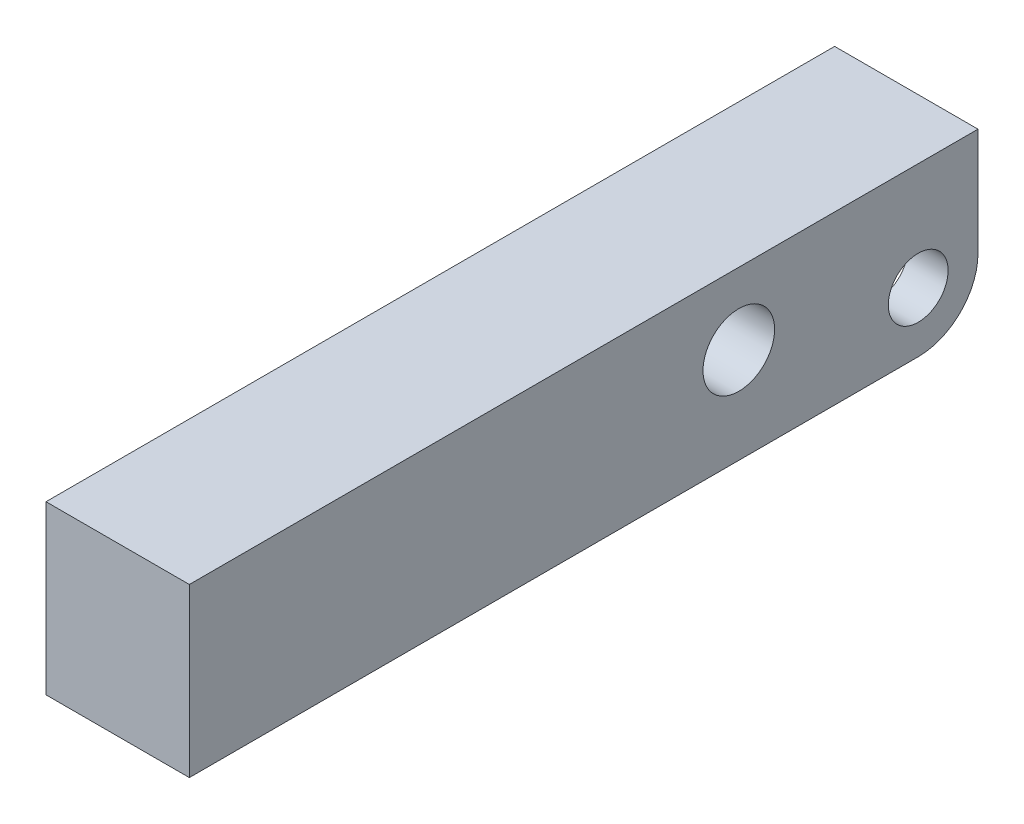
ISO-10303-21;
HEADER;
FILE_DESCRIPTION(('STEP AP214'),'2;1');
FILE_NAME('part.step','',(''),(''),'','','');
FILE_SCHEMA(('AUTOMOTIVE_DESIGN { 1 0 10303 214 1 1 1 1 }'));
ENDSEC;
DATA;
#1=APPLICATION_CONTEXT('core data for automotive mechanical design processes');
#2=APPLICATION_PROTOCOL_DEFINITION('international standard','automotive_design',2000,#1);
#3=PRODUCT_CONTEXT('',#1,'mechanical');
#4=PRODUCT('Part','Part','',(#3));
#5=PRODUCT_RELATED_PRODUCT_CATEGORY('part','',(#4));
#6=PRODUCT_DEFINITION_FORMATION('','',#4);
#7=PRODUCT_DEFINITION_CONTEXT('part definition',#1,'design');
#8=PRODUCT_DEFINITION('design','',#6,#7);
#9=PRODUCT_DEFINITION_SHAPE('','',#8);
#10=(LENGTH_UNIT() NAMED_UNIT(*) SI_UNIT(.MILLI.,.METRE.));
#11=(NAMED_UNIT(*) PLANE_ANGLE_UNIT() SI_UNIT($,.RADIAN.));
#12=(NAMED_UNIT(*) SI_UNIT($,.STERADIAN.) SOLID_ANGLE_UNIT());
#13=UNCERTAINTY_MEASURE_WITH_UNIT(LENGTH_MEASURE(1.E-05),#10,'distance_accuracy_value','');
#14=(GEOMETRIC_REPRESENTATION_CONTEXT(3) GLOBAL_UNCERTAINTY_ASSIGNED_CONTEXT((#13)) GLOBAL_UNIT_ASSIGNED_CONTEXT((#10,
#11,#12)) REPRESENTATION_CONTEXT('',''));
#15=CARTESIAN_POINT('',(0.,0.,0.));
#16=DIRECTION('',(0.,0.,1.));
#17=DIRECTION('',(1.,0.,0.));
#18=AXIS2_PLACEMENT_3D('',#15,#16,#17);
#19=CARTESIAN_POINT('',(-49.9999,5.00379999999999,5.0038));
#20=DIRECTION('',(1.,0.,0.));
#21=DIRECTION('',(0.,0.,-1.));
#22=AXIS2_PLACEMENT_3D('',#19,#20,#21);
#23=CYLINDRICAL_SURFACE('',#22,2.5019);
#24=CARTESIAN_POINT('',(-2.6543,5.00379999999999,5.0038));
#25=DIRECTION('',(-1.,0.,0.));
#26=DIRECTION('',(0.,0.,1.));
#27=AXIS2_PLACEMENT_3D('',#24,#25,#26);
#28=CIRCLE('',#27,2.5019);
#29=CARTESIAN_POINT('',(-2.65430000000001,5.00379999999999,2.5019));
#30=VERTEX_POINT('',#29);
#31=EDGE_CURVE('E198',#30,#30,#28,.F.);
#32=CARTESIAN_POINT('',(-6.,5.00379999999999,5.0038));
#33=DIRECTION('',(-1.,0.,0.));
#34=DIRECTION('',(0.,0.,1.));
#35=AXIS2_PLACEMENT_3D('',#32,#33,#34);
#36=CIRCLE('',#35,2.5019);
#37=CARTESIAN_POINT('',(-6.,5.00379999999999,2.5019));
#38=VERTEX_POINT('',#37);
#39=EDGE_CURVE('E161',#38,#38,#36,.T.);
#40=CARTESIAN_POINT('',(-2.65430000000001,5.00379999999999,2.5019));
#41=CARTESIAN_POINT('',(-2.68915104166667,5.00379999999999,2.5019));
#42=CARTESIAN_POINT('',(-2.72400208333334,5.00379999999999,2.5019));
#43=CARTESIAN_POINT('',(-2.79370416666667,5.00379999999999,2.5019));
#44=CARTESIAN_POINT('',(-2.82855520833334,5.00379999999999,2.5019));
#45=CARTESIAN_POINT('',(-2.89825729166667,5.00379999999999,2.5019));
#46=CARTESIAN_POINT('',(-2.93310833333334,5.00379999999999,2.5019));
#47=CARTESIAN_POINT('',(-3.00281041666667,5.00379999999999,2.5019));
#48=CARTESIAN_POINT('',(-3.03766145833334,5.00379999999999,2.5019));
#49=CARTESIAN_POINT('',(-3.10736354166667,5.00379999999999,2.5019));
#50=CARTESIAN_POINT('',(-3.14221458333334,5.00379999999999,2.5019));
#51=CARTESIAN_POINT('',(-3.21191666666667,5.00379999999999,2.5019));
#52=CARTESIAN_POINT('',(-3.24676770833334,5.00379999999999,2.5019));
#53=CARTESIAN_POINT('',(-3.31646979166667,5.00379999999999,2.5019));
#54=CARTESIAN_POINT('',(-3.35132083333334,5.00379999999999,2.5019));
#55=CARTESIAN_POINT('',(-3.42102291666667,5.00379999999999,2.5019));
#56=CARTESIAN_POINT('',(-3.45587395833334,5.00379999999999,2.5019));
#57=CARTESIAN_POINT('',(-3.52557604166667,5.00379999999999,2.5019));
#58=CARTESIAN_POINT('',(-3.56042708333334,5.00379999999999,2.5019));
#59=CARTESIAN_POINT('',(-3.63012916666667,5.00379999999999,2.5019));
#60=CARTESIAN_POINT('',(-3.66498020833333,5.00379999999999,2.5019));
#61=CARTESIAN_POINT('',(-3.73468229166667,5.00379999999999,2.5019));
#62=CARTESIAN_POINT('',(-3.76953333333334,5.00379999999999,2.5019));
#63=CARTESIAN_POINT('',(-3.83923541666667,5.00379999999999,2.5019));
#64=CARTESIAN_POINT('',(-3.87408645833334,5.00379999999999,2.5019));
#65=CARTESIAN_POINT('',(-3.94378854166667,5.00379999999999,2.5019));
#66=CARTESIAN_POINT('',(-3.97863958333334,5.00379999999999,2.5019));
#67=CARTESIAN_POINT('',(-4.04834166666667,5.00379999999999,2.5019));
#68=CARTESIAN_POINT('',(-4.08319270833334,5.00379999999999,2.5019));
#69=CARTESIAN_POINT('',(-4.15289479166667,5.00379999999999,2.5019));
#70=CARTESIAN_POINT('',(-4.18774583333334,5.00379999999999,2.5019));
#71=CARTESIAN_POINT('',(-4.25744791666667,5.00379999999999,2.5019));
#72=CARTESIAN_POINT('',(-4.29229895833334,5.00379999999999,2.5019));
#73=CARTESIAN_POINT('',(-4.36200104166667,5.00379999999999,2.5019));
#74=CARTESIAN_POINT('',(-4.39685208333333,5.00379999999999,2.5019));
#75=CARTESIAN_POINT('',(-4.46655416666667,5.00379999999999,2.5019));
#76=CARTESIAN_POINT('',(-4.50140520833333,5.00379999999999,2.5019));
#77=CARTESIAN_POINT('',(-4.57110729166667,5.00379999999999,2.5019));
#78=CARTESIAN_POINT('',(-4.60595833333333,5.00379999999999,2.5019));
#79=CARTESIAN_POINT('',(-4.67566041666667,5.00379999999999,2.5019));
#80=CARTESIAN_POINT('',(-4.71051145833333,5.00379999999999,2.5019));
#81=CARTESIAN_POINT('',(-4.78021354166667,5.00379999999999,2.5019));
#82=CARTESIAN_POINT('',(-4.81506458333333,5.00379999999999,2.5019));
#83=CARTESIAN_POINT('',(-4.88476666666667,5.00379999999999,2.5019));
#84=CARTESIAN_POINT('',(-4.91961770833333,5.00379999999999,2.5019));
#85=CARTESIAN_POINT('',(-4.98931979166667,5.00379999999999,2.5019));
#86=CARTESIAN_POINT('',(-5.02417083333333,5.00379999999999,2.5019));
#87=CARTESIAN_POINT('',(-5.09387291666667,5.00379999999999,2.5019));
#88=CARTESIAN_POINT('',(-5.12872395833333,5.00379999999999,2.5019));
#89=CARTESIAN_POINT('',(-5.19842604166667,5.00379999999999,2.5019));
#90=CARTESIAN_POINT('',(-5.23327708333333,5.00379999999999,2.5019));
#91=CARTESIAN_POINT('',(-5.30297916666667,5.00379999999999,2.5019));
#92=CARTESIAN_POINT('',(-5.33783020833333,5.00379999999999,2.5019));
#93=CARTESIAN_POINT('',(-5.40753229166666,5.00379999999999,2.5019));
#94=CARTESIAN_POINT('',(-5.44238333333333,5.00379999999999,2.5019));
#95=CARTESIAN_POINT('',(-5.51208541666667,5.00379999999999,2.5019));
#96=CARTESIAN_POINT('',(-5.54693645833333,5.00379999999999,2.5019));
#97=CARTESIAN_POINT('',(-5.61663854166667,5.00379999999999,2.5019));
#98=CARTESIAN_POINT('',(-5.65148958333333,5.00379999999999,2.5019));
#99=CARTESIAN_POINT('',(-5.72119166666667,5.00379999999999,2.5019));
#100=CARTESIAN_POINT('',(-5.75604270833333,5.00379999999999,2.5019));
#101=CARTESIAN_POINT('',(-5.82574479166667,5.00379999999999,2.5019));
#102=CARTESIAN_POINT('',(-5.86059583333333,5.00379999999999,2.5019));
#103=CARTESIAN_POINT('',(-5.93029791666667,5.00379999999999,2.5019));
#104=CARTESIAN_POINT('',(-5.96514895833333,5.00379999999999,2.5019));
#105=CARTESIAN_POINT('',(-6.,5.00379999999999,2.5019));
#106=B_SPLINE_CURVE_WITH_KNOTS('',3,(#40,#41,#42,#43,#44,#45,#46,#47,#48,#49,#50,#51,#52,#53,
#54,#55,#56,#57,#58,#59,#60,#61,#62,#63,#64,#65,#66,#67,#68,#69,#70,#71,#72,#73,#74,#75,#76,#77,
#78,#79,#80,#81,#82,#83,#84,#85,#86,#87,#88,#89,#90,#91,#92,#93,#94,#95,#96,#97,#98,#99,#100,
#101,#102,#103,#104,#105),.UNSPECIFIED.,.F.,.F.,(4,2,2,2,2,2,2,2,2,2,2,2,2,2,2,2,2,2,2,2,2,2,2,
2,2,2,2,2,2,2,2,2,4),(0.,0.104553124999997,0.20910625,0.313659374999997,0.418212500000001,
0.522765624999998,0.627318750000001,0.731871874999998,0.836425000000002,0.940978124999998,
1.04553125,1.150084375,1.2546375,1.359190625,1.46374375,1.568296875,1.67285,1.77740312499999,
1.88195625,1.98650937499999,2.0910625,2.19561562499999,2.30016875,2.40472187499999,
2.50927499999999,2.613828125,2.71838124999999,2.822934375,2.92748749999999,3.032040625,
3.13659374999999,3.241146875,3.34569999999999),.UNSPECIFIED.);
#107=EDGE_CURVE('BSEAM32',#30,#38,#106,.T.);
#108=ORIENTED_EDGE('',*,*,#31,.T.);
#109=ORIENTED_EDGE('',*,*,#39,.T.);
#110=ORIENTED_EDGE('',*,*,#107,.T.);
#111=ORIENTED_EDGE('',*,*,#107,.F.);
#112=EDGE_LOOP('',(#108,#110,#109,#111));
#113=FACE_BOUND('',#112,.T.);
#114=ADVANCED_FACE('F32',(#113),#23,.F.);
#115=CARTESIAN_POINT('',(-6.,13.9954,0.));
#116=DIRECTION('',(0.,0.,-1.));
#117=DIRECTION('',(0.,1.,0.));
#118=AXIS2_PLACEMENT_3D('',#115,#116,#117);
#119=PLANE('',#118);
#120=DIRECTION('',(0.,1.,0.));
#121=VECTOR('',#120,1.);
#122=CARTESIAN_POINT('',(5.9944,13.9954,0.));
#123=LINE('',#122,#121);
#124=CARTESIAN_POINT('',(5.9944,5.0038,0.));
#125=VERTEX_POINT('',#124);
#126=CARTESIAN_POINT('',(5.9944,13.9954,0.));
#127=VERTEX_POINT('',#126);
#128=EDGE_CURVE('E164',#125,#127,#123,.T.);
#129=ORIENTED_EDGE('',*,*,#128,.F.);
#130=DIRECTION('',(1.,0.,0.));
#131=VECTOR('',#130,1.);
#132=CARTESIAN_POINT('',(-6.,5.0038,0.));
#133=LINE('',#132,#131);
#134=CARTESIAN_POINT('',(2.6543,5.0038,0.));
#135=VERTEX_POINT('',#134);
#136=EDGE_CURVE('E211',#125,#135,#133,.F.);
#137=ORIENTED_EDGE('',*,*,#136,.T.);
#138=DIRECTION('',(0.,-1.,0.));
#139=VECTOR('',#138,1.);
#140=CARTESIAN_POINT('',(2.6543,10.9982,0.));
#141=LINE('',#140,#139);
#142=CARTESIAN_POINT('',(2.6543,10.9982,0.));
#143=VERTEX_POINT('',#142);
#144=EDGE_CURVE('E131',#143,#135,#141,.T.);
#145=ORIENTED_EDGE('',*,*,#144,.F.);
#146=DIRECTION('',(1.,0.,0.));
#147=VECTOR('',#146,1.);
#148=CARTESIAN_POINT('',(-2.6543,10.9982,0.));
#149=LINE('',#148,#147);
#150=CARTESIAN_POINT('',(-2.6543,10.9982,0.));
#151=VERTEX_POINT('',#150);
#152=EDGE_CURVE('E138',#151,#143,#149,.T.);
#153=ORIENTED_EDGE('',*,*,#152,.F.);
#154=DIRECTION('',(0.,-1.,0.));
#155=VECTOR('',#154,1.);
#156=CARTESIAN_POINT('',(-2.6543,10.9982,0.));
#157=LINE('',#156,#155);
#158=CARTESIAN_POINT('',(-2.6543,5.0038,0.));
#159=VERTEX_POINT('',#158);
#160=EDGE_CURVE('E121',#151,#159,#157,.T.);
#161=ORIENTED_EDGE('',*,*,#160,.T.);
#162=DIRECTION('',(1.,0.,0.));
#163=VECTOR('',#162,1.);
#164=CARTESIAN_POINT('',(-6.,5.0038,0.));
#165=LINE('',#164,#163);
#166=CARTESIAN_POINT('',(-6.,5.0038,0.));
#167=VERTEX_POINT('',#166);
#168=EDGE_CURVE('E209',#159,#167,#165,.F.);
#169=ORIENTED_EDGE('',*,*,#168,.T.);
#170=DIRECTION('',(0.,1.,0.));
#171=VECTOR('',#170,1.);
#172=CARTESIAN_POINT('',(-6.,13.9954,0.));
#173=LINE('',#172,#171);
#174=CARTESIAN_POINT('',(-6.,13.9954,0.));
#175=VERTEX_POINT('',#174);
#176=EDGE_CURVE('E175',#167,#175,#173,.T.);
#177=ORIENTED_EDGE('',*,*,#176,.T.);
#178=DIRECTION('',(1.,0.,0.));
#179=VECTOR('',#178,1.);
#180=CARTESIAN_POINT('',(-6.,13.9954,0.));
#181=LINE('',#180,#179);
#182=EDGE_CURVE('E186',#175,#127,#181,.T.);
#183=ORIENTED_EDGE('',*,*,#182,.T.);
#184=EDGE_LOOP('',(#129,#137,#145,#153,#161,#169,#177,#183));
#185=FACE_BOUND('',#184,.T.);
#186=ADVANCED_FACE('F143',(#185),#119,.T.);
#187=CARTESIAN_POINT('',(-6.,0.,0.));
#188=DIRECTION('',(0.,-1.,0.));
#189=DIRECTION('',(0.,0.,-1.));
#190=AXIS2_PLACEMENT_3D('',#187,#188,#189);
#191=PLANE('',#190);
#192=CARTESIAN_POINT('',(0.,0.,10.9855));
#193=DIRECTION('',(0.,-1.,0.));
#194=DIRECTION('',(0.,0.,-1.));
#195=AXIS2_PLACEMENT_3D('',#192,#193,#194);
#196=CIRCLE('',#195,3.4163);
#197=CARTESIAN_POINT('',(-3.4163,0.,10.9855));
#198=VERTEX_POINT('',#197);
#199=CARTESIAN_POINT('',(3.4163,0.,10.9855));
#200=VERTEX_POINT('',#199);
#201=EDGE_CURVE('E224',#198,#200,#196,.F.);
#202=ORIENTED_EDGE('',*,*,#201,.T.);
#203=DIRECTION('',(0.,0.,-1.));
#204=VECTOR('',#203,1.);
#205=CARTESIAN_POINT('',(3.4163,0.,5.0038));
#206=LINE('',#205,#204);
#207=CARTESIAN_POINT('',(3.4163,0.,5.0038));
#208=VERTEX_POINT('',#207);
#209=EDGE_CURVE('E226',#200,#208,#206,.T.);
#210=ORIENTED_EDGE('',*,*,#209,.T.);
#211=DIRECTION('',(1.,0.,0.));
#212=VECTOR('',#211,1.);
#213=CARTESIAN_POINT('',(-6.,0.,5.0038));
#214=LINE('',#213,#212);
#215=CARTESIAN_POINT('',(5.9944,0.,5.0038));
#216=VERTEX_POINT('',#215);
#217=EDGE_CURVE('E205',#208,#216,#214,.T.);
#218=ORIENTED_EDGE('',*,*,#217,.T.);
#219=DIRECTION('',(0.,0.,-1.));
#220=VECTOR('',#219,1.);
#221=CARTESIAN_POINT('',(5.9944,0.,0.));
#222=LINE('',#221,#220);
#223=CARTESIAN_POINT('',(5.9944,0.,65.9892));
#224=VERTEX_POINT('',#223);
#225=EDGE_CURVE('E172',#224,#216,#222,.T.);
#226=ORIENTED_EDGE('',*,*,#225,.F.);
#227=DIRECTION('',(1.,0.,0.));
#228=VECTOR('',#227,1.);
#229=CARTESIAN_POINT('',(-6.,0.,65.9892));
#230=LINE('',#229,#228);
#231=CARTESIAN_POINT('',(-6.,0.,65.9892));
#232=VERTEX_POINT('',#231);
#233=EDGE_CURVE('E187',#232,#224,#230,.T.);
#234=ORIENTED_EDGE('',*,*,#233,.F.);
#235=DIRECTION('',(0.,0.,-1.));
#236=VECTOR('',#235,1.);
#237=CARTESIAN_POINT('',(-6.,0.,0.));
#238=LINE('',#237,#236);
#239=CARTESIAN_POINT('',(-6.,0.,5.0038));
#240=VERTEX_POINT('',#239);
#241=EDGE_CURVE('E183',#232,#240,#238,.T.);
#242=ORIENTED_EDGE('',*,*,#241,.T.);
#243=DIRECTION('',(1.,0.,0.));
#244=VECTOR('',#243,1.);
#245=CARTESIAN_POINT('',(-6.,0.,5.0038));
#246=LINE('',#245,#244);
#247=CARTESIAN_POINT('',(-3.4163,0.,5.0038));
#248=VERTEX_POINT('',#247);
#249=EDGE_CURVE('E189',#240,#248,#246,.T.);
#250=ORIENTED_EDGE('',*,*,#249,.T.);
#251=DIRECTION('',(0.,0.,1.));
#252=VECTOR('',#251,1.);
#253=CARTESIAN_POINT('',(-3.4163,0.,10.9855));
#254=LINE('',#253,#252);
#255=EDGE_CURVE('E222',#248,#198,#254,.T.);
#256=ORIENTED_EDGE('',*,*,#255,.T.);
#257=EDGE_LOOP('',(#202,#210,#218,#226,#234,#242,#250,#256));
#258=FACE_BOUND('',#257,.T.);
#259=ADVANCED_FACE('F249',(#258),#191,.T.);
#260=CARTESIAN_POINT('',(-6.,0.,65.9892));
#261=DIRECTION('',(0.,0.,1.));
#262=DIRECTION('',(1.,0.,0.));
#263=AXIS2_PLACEMENT_3D('',#260,#261,#262);
#264=PLANE('',#263);
#265=ORIENTED_EDGE('',*,*,#233,.T.);
#266=DIRECTION('',(0.,-1.,0.));
#267=VECTOR('',#266,1.);
#268=CARTESIAN_POINT('',(5.9944,0.,65.9892));
#269=LINE('',#268,#267);
#270=CARTESIAN_POINT('',(5.9944,13.9954,65.9892));
#271=VERTEX_POINT('',#270);
#272=EDGE_CURVE('E169',#271,#224,#269,.T.);
#273=ORIENTED_EDGE('',*,*,#272,.F.);
#274=DIRECTION('',(1.,0.,0.));
#275=VECTOR('',#274,1.);
#276=CARTESIAN_POINT('',(-6.,13.9954,65.9892));
#277=LINE('',#276,#275);
#278=CARTESIAN_POINT('',(-6.,13.9954,65.9892));
#279=VERTEX_POINT('',#278);
#280=EDGE_CURVE('E190',#279,#271,#277,.T.);
#281=ORIENTED_EDGE('',*,*,#280,.F.);
#282=DIRECTION('',(0.,-1.,0.));
#283=VECTOR('',#282,1.);
#284=CARTESIAN_POINT('',(-6.,0.,65.9892));
#285=LINE('',#284,#283);
#286=EDGE_CURVE('E180',#279,#232,#285,.T.);
#287=ORIENTED_EDGE('',*,*,#286,.T.);
#288=EDGE_LOOP('',(#265,#273,#281,#287));
#289=FACE_BOUND('',#288,.T.);
#290=ADVANCED_FACE('F265',(#289),#264,.T.);
#291=CARTESIAN_POINT('',(-6.,13.9954,65.9892));
#292=DIRECTION('',(0.,1.,0.));
#293=DIRECTION('',(0.,0.,1.));
#294=AXIS2_PLACEMENT_3D('',#291,#292,#293);
#295=PLANE('',#294);
#296=ORIENTED_EDGE('',*,*,#280,.T.);
#297=DIRECTION('',(0.,0.,1.));
#298=VECTOR('',#297,1.);
#299=CARTESIAN_POINT('',(5.9944,13.9954,65.9892));
#300=LINE('',#299,#298);
#301=EDGE_CURVE('E166',#127,#271,#300,.T.);
#302=ORIENTED_EDGE('',*,*,#301,.F.);
#303=ORIENTED_EDGE('',*,*,#182,.F.);
#304=DIRECTION('',(0.,0.,1.));
#305=VECTOR('',#304,1.);
#306=CARTESIAN_POINT('',(-6.,13.9954,65.9892));
#307=LINE('',#306,#305);
#308=EDGE_CURVE('E177',#175,#279,#307,.T.);
#309=ORIENTED_EDGE('',*,*,#308,.T.);
#310=EDGE_LOOP('',(#296,#302,#303,#309));
#311=FACE_BOUND('',#310,.T.);
#312=ADVANCED_FACE('F260',(#311),#295,.T.);
#313=CARTESIAN_POINT('',(-6.,0.,0.));
#314=DIRECTION('',(-1.,0.,0.));
#315=DIRECTION('',(0.,0.,1.));
#316=AXIS2_PLACEMENT_3D('',#313,#314,#315);
#317=PLANE('',#316);
#318=CARTESIAN_POINT('',(-6.,8.00099999999999,20.0152));
#319=DIRECTION('',(-1.,0.,0.));
#320=DIRECTION('',(0.,0.,1.));
#321=AXIS2_PLACEMENT_3D('',#318,#319,#320);
#322=CIRCLE('',#321,2.9972);
#323=CARTESIAN_POINT('',(-6.,8.00099999999999,17.018));
#324=VERTEX_POINT('',#323);
#325=EDGE_CURVE('E156',#324,#324,#322,.T.);
#326=ORIENTED_EDGE('',*,*,#325,.F.);
#327=EDGE_LOOP('',(#326));
#328=FACE_BOUND('',#327,.T.);
#329=ORIENTED_EDGE('',*,*,#39,.F.);
#330=EDGE_LOOP('',(#329));
#331=FACE_BOUND('',#330,.T.);
#332=ORIENTED_EDGE('',*,*,#176,.F.);
#333=CARTESIAN_POINT('',(-6.,5.0038,5.0038));
#334=DIRECTION('',(-1.,0.,0.));
#335=DIRECTION('',(0.,0.,1.));
#336=AXIS2_PLACEMENT_3D('',#333,#334,#335);
#337=CIRCLE('',#336,5.0038);
#338=EDGE_CURVE('E217',#167,#240,#337,.T.);
#339=ORIENTED_EDGE('',*,*,#338,.T.);
#340=ORIENTED_EDGE('',*,*,#241,.F.);
#341=ORIENTED_EDGE('',*,*,#286,.F.);
#342=ORIENTED_EDGE('',*,*,#308,.F.);
#343=EDGE_LOOP('',(#332,#339,#340,#341,#342));
#344=FACE_BOUND('',#343,.T.);
#345=ADVANCED_FACE('F255',(#328,#331,#344),#317,.T.);
#346=CARTESIAN_POINT('',(5.9944,0.,0.));
#347=DIRECTION('',(-1.,0.,0.));
#348=DIRECTION('',(0.,0.,1.));
#349=AXIS2_PLACEMENT_3D('',#346,#347,#348);
#350=PLANE('',#349);
#351=CARTESIAN_POINT('',(5.9944,8.00099999999999,20.0152));
#352=DIRECTION('',(-1.,0.,0.));
#353=DIRECTION('',(0.,0.,1.));
#354=AXIS2_PLACEMENT_3D('',#351,#352,#353);
#355=CIRCLE('',#354,2.9972);
#356=CARTESIAN_POINT('',(5.9944,8.00099999999999,17.018));
#357=VERTEX_POINT('',#356);
#358=EDGE_CURVE('E160',#357,#357,#355,.T.);
#359=ORIENTED_EDGE('',*,*,#358,.T.);
#360=EDGE_LOOP('',(#359));
#361=FACE_BOUND('',#360,.T.);
#362=CARTESIAN_POINT('',(5.9944,5.00379999999999,5.0038));
#363=DIRECTION('',(-1.,0.,0.));
#364=DIRECTION('',(0.,0.,1.));
#365=AXIS2_PLACEMENT_3D('',#362,#363,#364);
#366=CIRCLE('',#365,2.5019);
#367=CARTESIAN_POINT('',(5.9944,5.00379999999999,2.5019));
#368=VERTEX_POINT('',#367);
#369=EDGE_CURVE('E159',#368,#368,#366,.T.);
#370=ORIENTED_EDGE('',*,*,#369,.T.);
#371=EDGE_LOOP('',(#370));
#372=FACE_BOUND('',#371,.T.);
#373=ORIENTED_EDGE('',*,*,#225,.T.);
#374=CARTESIAN_POINT('',(5.9944,5.0038,5.0038));
#375=DIRECTION('',(-1.,0.,0.));
#376=DIRECTION('',(0.,0.,1.));
#377=AXIS2_PLACEMENT_3D('',#374,#375,#376);
#378=CIRCLE('',#377,5.0038);
#379=EDGE_CURVE('E207',#216,#125,#378,.F.);
#380=ORIENTED_EDGE('',*,*,#379,.T.);
#381=ORIENTED_EDGE('',*,*,#128,.T.);
#382=ORIENTED_EDGE('',*,*,#301,.T.);
#383=ORIENTED_EDGE('',*,*,#272,.T.);
#384=EDGE_LOOP('',(#373,#380,#381,#382,#383));
#385=FACE_BOUND('',#384,.T.);
#386=ADVANCED_FACE('F263',(#361,#372,#385),#350,.F.);
#387=CARTESIAN_POINT('',(2.6543,5.00379999999999,5.0038));
#388=DIRECTION('',(1.,0.,0.));
#389=DIRECTION('',(0.,0.,-1.));
#390=AXIS2_PLACEMENT_3D('',#387,#388,#389);
#391=CIRCLE('',#390,2.5019);
#392=CARTESIAN_POINT('',(2.65430000000001,5.00379999999999,2.5019));
#393=VERTEX_POINT('',#392);
#394=EDGE_CURVE('E152',#393,#393,#391,.F.);
#395=CARTESIAN_POINT('',(2.65430000000001,5.00379999999999,2.5019));
#396=CARTESIAN_POINT('',(2.68909270833334,5.00379999999999,2.5019));
#397=CARTESIAN_POINT('',(2.72388541666667,5.00379999999999,2.5019));
#398=CARTESIAN_POINT('',(2.79347083333334,5.00379999999999,2.5019));
#399=CARTESIAN_POINT('',(2.82826354166667,5.00379999999999,2.5019));
#400=CARTESIAN_POINT('',(2.89784895833334,5.00379999999999,2.5019));
#401=CARTESIAN_POINT('',(2.93264166666667,5.00379999999999,2.5019));
#402=CARTESIAN_POINT('',(3.00222708333334,5.00379999999999,2.5019));
#403=CARTESIAN_POINT('',(3.03701979166667,5.00379999999999,2.5019));
#404=CARTESIAN_POINT('',(3.10660520833334,5.00379999999999,2.5019));
#405=CARTESIAN_POINT('',(3.14139791666667,5.00379999999999,2.5019));
#406=CARTESIAN_POINT('',(3.21098333333334,5.00379999999999,2.5019));
#407=CARTESIAN_POINT('',(3.24577604166667,5.00379999999999,2.5019));
#408=CARTESIAN_POINT('',(3.31536145833334,5.00379999999999,2.5019));
#409=CARTESIAN_POINT('',(3.35015416666667,5.00379999999999,2.5019));
#410=CARTESIAN_POINT('',(3.41973958333334,5.00379999999999,2.5019));
#411=CARTESIAN_POINT('',(3.45453229166667,5.00379999999999,2.5019));
#412=CARTESIAN_POINT('',(3.52411770833334,5.00379999999999,2.5019));
#413=CARTESIAN_POINT('',(3.55891041666667,5.00379999999999,2.5019));
#414=CARTESIAN_POINT('',(3.62849583333334,5.00379999999999,2.5019));
#415=CARTESIAN_POINT('',(3.66328854166667,5.00379999999999,2.5019));
#416=CARTESIAN_POINT('',(3.73287395833334,5.00379999999999,2.5019));
#417=CARTESIAN_POINT('',(3.76766666666667,5.00379999999999,2.5019));
#418=CARTESIAN_POINT('',(3.83725208333334,5.00379999999999,2.5019));
#419=CARTESIAN_POINT('',(3.87204479166667,5.00379999999999,2.5019));
#420=CARTESIAN_POINT('',(3.94163020833334,5.00379999999999,2.5019));
#421=CARTESIAN_POINT('',(3.97642291666667,5.00379999999999,2.5019));
#422=CARTESIAN_POINT('',(4.04600833333334,5.00379999999999,2.5019));
#423=CARTESIAN_POINT('',(4.08080104166667,5.00379999999999,2.5019));
#424=CARTESIAN_POINT('',(4.15038645833334,5.00379999999999,2.5019));
#425=CARTESIAN_POINT('',(4.18517916666667,5.00379999999999,2.5019));
#426=CARTESIAN_POINT('',(4.25476458333334,5.00379999999999,2.5019));
#427=CARTESIAN_POINT('',(4.28955729166667,5.00379999999999,2.5019));
#428=CARTESIAN_POINT('',(4.35914270833334,5.00379999999999,2.5019));
#429=CARTESIAN_POINT('',(4.39393541666667,5.00379999999999,2.5019));
#430=CARTESIAN_POINT('',(4.46352083333334,5.00379999999999,2.5019));
#431=CARTESIAN_POINT('',(4.49831354166667,5.00379999999999,2.5019));
#432=CARTESIAN_POINT('',(4.56789895833334,5.00379999999999,2.5019));
#433=CARTESIAN_POINT('',(4.60269166666667,5.00379999999999,2.5019));
#434=CARTESIAN_POINT('',(4.67227708333334,5.00379999999999,2.5019));
#435=CARTESIAN_POINT('',(4.70706979166667,5.00379999999999,2.5019));
#436=CARTESIAN_POINT('',(4.77665520833334,5.00379999999999,2.5019));
#437=CARTESIAN_POINT('',(4.81144791666667,5.00379999999999,2.5019));
#438=CARTESIAN_POINT('',(4.88103333333334,5.00379999999999,2.5019));
#439=CARTESIAN_POINT('',(4.91582604166667,5.00379999999999,2.5019));
#440=CARTESIAN_POINT('',(4.98541145833334,5.00379999999999,2.5019));
#441=CARTESIAN_POINT('',(5.02020416666667,5.00379999999999,2.5019));
#442=CARTESIAN_POINT('',(5.08978958333334,5.00379999999999,2.5019));
#443=CARTESIAN_POINT('',(5.12458229166667,5.00379999999999,2.5019));
#444=CARTESIAN_POINT('',(5.19416770833334,5.00379999999999,2.5019));
#445=CARTESIAN_POINT('',(5.22896041666667,5.00379999999999,2.5019));
#446=CARTESIAN_POINT('',(5.29854583333334,5.00379999999999,2.5019));
#447=CARTESIAN_POINT('',(5.33333854166667,5.00379999999999,2.5019));
#448=CARTESIAN_POINT('',(5.40292395833334,5.00379999999999,2.5019));
#449=CARTESIAN_POINT('',(5.43771666666667,5.00379999999999,2.5019));
#450=CARTESIAN_POINT('',(5.50730208333334,5.00379999999999,2.5019));
#451=CARTESIAN_POINT('',(5.54209479166667,5.00379999999999,2.5019));
#452=CARTESIAN_POINT('',(5.61168020833334,5.00379999999999,2.5019));
#453=CARTESIAN_POINT('',(5.64647291666667,5.00379999999999,2.5019));
#454=CARTESIAN_POINT('',(5.71605833333334,5.00379999999999,2.5019));
#455=CARTESIAN_POINT('',(5.75085104166667,5.00379999999999,2.5019));
#456=CARTESIAN_POINT('',(5.82043645833334,5.00379999999999,2.5019));
#457=CARTESIAN_POINT('',(5.85522916666667,5.00379999999999,2.5019));
#458=CARTESIAN_POINT('',(5.92481458333334,5.00379999999999,2.5019));
#459=CARTESIAN_POINT('',(5.95960729166667,5.00379999999999,2.5019));
#460=CARTESIAN_POINT('',(5.9944,5.00379999999999,2.5019));
#461=B_SPLINE_CURVE_WITH_KNOTS('',3,(#395,#396,#397,#398,#399,#400,#401,#402,#403,#404,#405,
#406,#407,#408,#409,#410,#411,#412,#413,#414,#415,#416,#417,#418,#419,#420,#421,#422,#423,#424,
#425,#426,#427,#428,#429,#430,#431,#432,#433,#434,#435,#436,#437,#438,#439,#440,#441,#442,#443,
#444,#445,#446,#447,#448,#449,#450,#451,#452,#453,#454,#455,#456,#457,#458,#459,#460),
.UNSPECIFIED.,.F.,.F.,(4,2,2,2,2,2,2,2,2,2,2,2,2,2,2,2,2,2,2,2,2,2,2,2,2,2,2,2,2,2,2,2,4),(0.,
0.104378124999999,0.208756249999997,0.313134375000003,0.417512500000002,0.521890625,
0.626268749999999,0.730646874999997,0.835025000000003,0.939403125000002,1.04378125,1.148159375,
1.2525375,1.356915625,1.46129375,1.565671875,1.67005,1.774428125,1.87880625,1.983184375,
2.0875625,2.191940625,2.29631875,2.400696875,2.505075,2.609453125,2.71383125,2.818209375,
2.9225875,3.026965625,3.13134375,3.235721875,3.3401),.UNSPECIFIED.);
#462=EDGE_CURVE('BSEAM277',#393,#368,#461,.T.);
#463=ORIENTED_EDGE('',*,*,#394,.T.);
#464=ORIENTED_EDGE('',*,*,#369,.F.);
#465=ORIENTED_EDGE('',*,*,#462,.T.);
#466=ORIENTED_EDGE('',*,*,#462,.F.);
#467=EDGE_LOOP('',(#463,#465,#464,#466));
#468=FACE_BOUND('',#467,.T.);
#469=ADVANCED_FACE('F277',(#468),#23,.F.);
#470=CARTESIAN_POINT('',(-49.9999,8.00099999999999,20.0152));
#471=DIRECTION('',(1.,0.,0.));
#472=DIRECTION('',(0.,0.,-1.));
#473=AXIS2_PLACEMENT_3D('',#470,#471,#472);
#474=CYLINDRICAL_SURFACE('',#473,2.9972);
#475=CARTESIAN_POINT('',(-6.,8.00099999999999,17.018));
#476=CARTESIAN_POINT('',(-5.87505833333333,8.00099999999999,17.018));
#477=CARTESIAN_POINT('',(-5.75011666666666,8.00099999999999,17.018));
#478=CARTESIAN_POINT('',(-5.50023333333333,8.00099999999999,17.018));
#479=CARTESIAN_POINT('',(-5.37529166666667,8.00099999999999,17.018));
#480=CARTESIAN_POINT('',(-5.12540833333333,8.00099999999999,17.018));
#481=CARTESIAN_POINT('',(-5.00046666666667,8.00099999999999,17.018));
#482=CARTESIAN_POINT('',(-4.75058333333333,8.00099999999999,17.018));
#483=CARTESIAN_POINT('',(-4.62564166666666,8.00099999999999,17.018));
#484=CARTESIAN_POINT('',(-4.37575833333333,8.00099999999999,17.018));
#485=CARTESIAN_POINT('',(-4.25081666666667,8.00099999999999,17.018));
#486=CARTESIAN_POINT('',(-4.00093333333333,8.00099999999999,17.018));
#487=CARTESIAN_POINT('',(-3.87599166666667,8.00099999999999,17.018));
#488=CARTESIAN_POINT('',(-3.62610833333333,8.00099999999999,17.018));
#489=CARTESIAN_POINT('',(-3.50116666666666,8.00099999999999,17.018));
#490=CARTESIAN_POINT('',(-3.25128333333333,8.00099999999999,17.018));
#491=CARTESIAN_POINT('',(-3.12634166666666,8.00099999999999,17.018));
#492=CARTESIAN_POINT('',(-2.87645833333333,8.00099999999999,17.018));
#493=CARTESIAN_POINT('',(-2.75151666666666,8.00099999999999,17.018));
#494=CARTESIAN_POINT('',(-2.50163333333333,8.00099999999999,17.018));
#495=CARTESIAN_POINT('',(-2.37669166666666,8.00099999999999,17.018));
#496=CARTESIAN_POINT('',(-2.12680833333333,8.00099999999999,17.018));
#497=CARTESIAN_POINT('',(-2.00186666666666,8.00099999999999,17.018));
#498=CARTESIAN_POINT('',(-1.75198333333333,8.00099999999999,17.018));
#499=CARTESIAN_POINT('',(-1.62704166666666,8.00099999999999,17.018));
#500=CARTESIAN_POINT('',(-1.37715833333333,8.00099999999999,17.018));
#501=CARTESIAN_POINT('',(-1.25221666666666,8.00099999999999,17.018));
#502=CARTESIAN_POINT('',(-1.00233333333333,8.00099999999999,17.018));
#503=CARTESIAN_POINT('',(-0.877391666666662,8.00099999999999,17.018));
#504=CARTESIAN_POINT('',(-0.62750833333333,8.00099999999999,17.018));
#505=CARTESIAN_POINT('',(-0.502566666666665,8.00099999999999,17.018));
#506=CARTESIAN_POINT('',(-0.252683333333332,8.00099999999999,17.018));
#507=CARTESIAN_POINT('',(-0.127741666666665,8.00099999999999,17.018));
#508=CARTESIAN_POINT('',(0.12214166666667,8.00099999999999,17.018));
#509=CARTESIAN_POINT('',(0.247083333333338,8.00099999999999,17.018));
#510=CARTESIAN_POINT('',(0.49696666666667,8.00099999999999,17.018));
#511=CARTESIAN_POINT('',(0.621908333333335,8.00099999999999,17.018));
#512=CARTESIAN_POINT('',(0.871791666666668,8.00099999999999,17.018));
#513=CARTESIAN_POINT('',(0.996733333333335,8.00099999999999,17.018));
#514=CARTESIAN_POINT('',(1.24661666666667,8.00099999999999,17.018));
#515=CARTESIAN_POINT('',(1.37155833333334,8.00099999999999,17.018));
#516=CARTESIAN_POINT('',(1.62144166666667,8.00099999999999,17.018));
#517=CARTESIAN_POINT('',(1.74638333333333,8.00099999999999,17.018));
#518=CARTESIAN_POINT('',(1.99626666666667,8.00099999999999,17.018));
#519=CARTESIAN_POINT('',(2.12120833333333,8.00099999999999,17.018));
#520=CARTESIAN_POINT('',(2.37109166666667,8.00099999999999,17.018));
#521=CARTESIAN_POINT('',(2.49603333333334,8.00099999999999,17.018));
#522=CARTESIAN_POINT('',(2.74591666666667,8.00099999999999,17.018));
#523=CARTESIAN_POINT('',(2.87085833333333,8.00099999999999,17.018));
#524=CARTESIAN_POINT('',(3.12074166666667,8.00099999999999,17.018));
#525=CARTESIAN_POINT('',(3.24568333333333,8.00099999999999,17.018));
#526=CARTESIAN_POINT('',(3.49556666666667,8.00099999999999,17.018));
#527=CARTESIAN_POINT('',(3.62050833333334,8.00099999999999,17.018));
#528=CARTESIAN_POINT('',(3.87039166666667,8.00099999999999,17.018));
#529=CARTESIAN_POINT('',(3.99533333333333,8.00099999999999,17.018));
#530=CARTESIAN_POINT('',(4.24521666666667,8.00099999999999,17.018));
#531=CARTESIAN_POINT('',(4.37015833333334,8.00099999999999,17.018));
#532=CARTESIAN_POINT('',(4.62004166666667,8.00099999999999,17.018));
#533=CARTESIAN_POINT('',(4.74498333333334,8.00099999999999,17.018));
#534=CARTESIAN_POINT('',(4.99486666666667,8.00099999999999,17.018));
#535=CARTESIAN_POINT('',(5.11980833333333,8.00099999999999,17.018));
#536=CARTESIAN_POINT('',(5.36969166666667,8.00099999999999,17.018));
#537=CARTESIAN_POINT('',(5.49463333333333,8.00099999999999,17.018));
#538=CARTESIAN_POINT('',(5.74451666666667,8.00099999999999,17.018));
#539=CARTESIAN_POINT('',(5.86945833333334,8.00099999999999,17.018));
#540=CARTESIAN_POINT('',(5.9944,8.00099999999999,17.018));
#541=B_SPLINE_CURVE_WITH_KNOTS('',3,(#475,#476,#477,#478,#479,#480,#481,#482,#483,#484,#485,
#486,#487,#488,#489,#490,#491,#492,#493,#494,#495,#496,#497,#498,#499,#500,#501,#502,#503,#504,
#505,#506,#507,#508,#509,#510,#511,#512,#513,#514,#515,#516,#517,#518,#519,#520,#521,#522,#523,
#524,#525,#526,#527,#528,#529,#530,#531,#532,#533,#534,#535,#536,#537,#538,#539,#540),
.UNSPECIFIED.,.F.,.F.,(4,2,2,2,2,2,2,2,2,2,2,2,2,2,2,2,2,2,2,2,2,2,2,2,2,2,2,2,2,2,2,2,4),(0.,
0.374825000000002,0.749649999999997,1.124475,1.4993,1.874125,2.24895,2.623775,2.9986,3.373425,
3.74825,4.123075,4.4979,4.872725,5.24755,5.622375,5.9972,6.372025,6.74685,7.121675,7.4965,
7.871325,8.24615,8.620975,8.9958,9.370625,9.74545,10.120275,10.4951,10.869925,11.24475,
11.619575,11.9944),.UNSPECIFIED.);
#542=EDGE_CURVE('BSEAM286',#324,#357,#541,.T.);
#543=ORIENTED_EDGE('',*,*,#325,.T.);
#544=ORIENTED_EDGE('',*,*,#358,.F.);
#545=ORIENTED_EDGE('',*,*,#542,.T.);
#546=ORIENTED_EDGE('',*,*,#542,.F.);
#547=EDGE_LOOP('',(#543,#545,#544,#546));
#548=FACE_BOUND('',#547,.T.);
#549=ADVANCED_FACE('F286',(#548),#474,.F.);
#550=CARTESIAN_POINT('',(-2.6543,10.9982,10.9855));
#551=DIRECTION('',(-1.,0.,0.));
#552=DIRECTION('',(0.,0.,1.));
#553=AXIS2_PLACEMENT_3D('',#550,#551,#552);
#554=PLANE('',#553);
#555=DIRECTION('',(0.,-1.,0.));
#556=VECTOR('',#555,1.);
#557=CARTESIAN_POINT('',(-2.6543,10.9982,10.9855));
#558=LINE('',#557,#556);
#559=CARTESIAN_POINT('',(-2.6543,10.9982,10.9855));
#560=VERTEX_POINT('',#559);
#561=CARTESIAN_POINT('',(-2.6543,0.76199999999999,10.9855));
#562=VERTEX_POINT('',#561);
#563=EDGE_CURVE('E150',#560,#562,#558,.T.);
#564=ORIENTED_EDGE('',*,*,#563,.T.);
#565=DIRECTION('',(0.,0.,-1.));
#566=VECTOR('',#565,1.);
#567=CARTESIAN_POINT('',(-2.6543,0.761999999999991,5.0038));
#568=LINE('',#567,#566);
#569=CARTESIAN_POINT('',(-2.6543,0.761999999999991,2.34953038294903));
#570=VERTEX_POINT('',#569);
#571=EDGE_CURVE('E41',#562,#570,#568,.T.);
#572=ORIENTED_EDGE('',*,*,#571,.T.);
#573=CARTESIAN_POINT('',(-2.6543,5.0038,5.0038));
#574=DIRECTION('',(-1.,0.,0.));
#575=DIRECTION('',(0.,0.,1.));
#576=AXIS2_PLACEMENT_3D('',#573,#574,#575);
#577=CIRCLE('',#576,5.0038);
#578=EDGE_CURVE('E127',#570,#159,#577,.F.);
#579=ORIENTED_EDGE('',*,*,#578,.T.);
#580=ORIENTED_EDGE('',*,*,#160,.F.);
#581=DIRECTION('',(0.,0.,-1.));
#582=VECTOR('',#581,1.);
#583=CARTESIAN_POINT('',(-2.6543,10.9982,10.9855));
#584=LINE('',#583,#582);
#585=EDGE_CURVE('E125',#560,#151,#584,.T.);
#586=ORIENTED_EDGE('',*,*,#585,.F.);
#587=EDGE_LOOP('',(#564,#572,#579,#580,#586));
#588=FACE_BOUND('',#587,.T.);
#589=ORIENTED_EDGE('',*,*,#31,.F.);
#590=EDGE_LOOP('',(#589));
#591=FACE_BOUND('',#590,.T.);
#592=ADVANCED_FACE('F123',(#588,#591),#554,.F.);
#593=CARTESIAN_POINT('',(2.6543,10.9982,10.9855));
#594=DIRECTION('',(1.,0.,0.));
#595=DIRECTION('',(0.,0.,-1.));
#596=AXIS2_PLACEMENT_3D('',#593,#594,#595);
#597=PLANE('',#596);
#598=CARTESIAN_POINT('',(2.6543,5.0038,5.0038));
#599=DIRECTION('',(1.,0.,0.));
#600=DIRECTION('',(0.,0.,-1.));
#601=AXIS2_PLACEMENT_3D('',#598,#599,#600);
#602=CIRCLE('',#601,5.0038);
#603=CARTESIAN_POINT('',(2.6543,0.76199999999999,2.34953038294903));
#604=VERTEX_POINT('',#603);
#605=EDGE_CURVE('E213',#135,#604,#602,.F.);
#606=ORIENTED_EDGE('',*,*,#605,.T.);
#607=DIRECTION('',(0.,0.,1.));
#608=VECTOR('',#607,1.);
#609=CARTESIAN_POINT('',(2.6543,0.76199999999999,10.9855));
#610=LINE('',#609,#608);
#611=CARTESIAN_POINT('',(2.6543,0.76199999999999,10.9855));
#612=VERTEX_POINT('',#611);
#613=EDGE_CURVE('E219',#604,#612,#610,.T.);
#614=ORIENTED_EDGE('',*,*,#613,.T.);
#615=DIRECTION('',(0.,-1.,0.));
#616=VECTOR('',#615,1.);
#617=CARTESIAN_POINT('',(2.6543,10.9982,10.9855));
#618=LINE('',#617,#616);
#619=CARTESIAN_POINT('',(2.6543,10.9982,10.9855));
#620=VERTEX_POINT('',#619);
#621=EDGE_CURVE('E153',#620,#612,#618,.T.);
#622=ORIENTED_EDGE('',*,*,#621,.F.);
#623=DIRECTION('',(0.,0.,1.));
#624=VECTOR('',#623,1.);
#625=CARTESIAN_POINT('',(2.6543,10.9982,10.9855));
#626=LINE('',#625,#624);
#627=EDGE_CURVE('E145',#143,#620,#626,.T.);
#628=ORIENTED_EDGE('',*,*,#627,.F.);
#629=ORIENTED_EDGE('',*,*,#144,.T.);
#630=EDGE_LOOP('',(#606,#614,#622,#628,#629));
#631=FACE_BOUND('',#630,.T.);
#632=ORIENTED_EDGE('',*,*,#394,.F.);
#633=EDGE_LOOP('',(#632));
#634=FACE_BOUND('',#633,.T.);
#635=ADVANCED_FACE('F299',(#631,#634),#597,.F.);
#636=CARTESIAN_POINT('',(0.,10.9982,10.9855));
#637=DIRECTION('',(0.,-1.,0.));
#638=DIRECTION('',(0.,0.,-1.));
#639=AXIS2_PLACEMENT_3D('',#636,#637,#638);
#640=CYLINDRICAL_SURFACE('',#639,2.6543);
#641=ORIENTED_EDGE('',*,*,#621,.T.);
#642=CARTESIAN_POINT('',(0.,0.76199999999999,10.9855));
#643=DIRECTION('',(0.,-1.,0.));
#644=DIRECTION('',(0.,0.,-1.));
#645=AXIS2_PLACEMENT_3D('',#642,#643,#644);
#646=CIRCLE('',#645,2.6543);
#647=EDGE_CURVE('E56',#612,#562,#646,.T.);
#648=ORIENTED_EDGE('',*,*,#647,.T.);
#649=ORIENTED_EDGE('',*,*,#563,.F.);
#650=CARTESIAN_POINT('',(0.,10.9982,10.9855));
#651=DIRECTION('',(0.,-1.,0.));
#652=DIRECTION('',(0.,0.,-1.));
#653=AXIS2_PLACEMENT_3D('',#650,#651,#652);
#654=CIRCLE('',#653,2.6543);
#655=EDGE_CURVE('E132',#620,#560,#654,.T.);
#656=ORIENTED_EDGE('',*,*,#655,.F.);
#657=EDGE_LOOP('',(#641,#648,#649,#656));
#658=FACE_BOUND('',#657,.T.);
#659=ADVANCED_FACE('F301',(#658),#640,.F.);
#660=CARTESIAN_POINT('',(0.,10.9982,10.9855));
#661=DIRECTION('',(0.,-1.,0.));
#662=DIRECTION('',(0.,0.,-1.));
#663=AXIS2_PLACEMENT_3D('',#660,#661,#662);
#664=PLANE('',#663);
#665=ORIENTED_EDGE('',*,*,#585,.T.);
#666=ORIENTED_EDGE('',*,*,#152,.T.);
#667=ORIENTED_EDGE('',*,*,#627,.T.);
#668=ORIENTED_EDGE('',*,*,#655,.T.);
#669=EDGE_LOOP('',(#665,#666,#667,#668));
#670=FACE_BOUND('',#669,.T.);
#671=ADVANCED_FACE('F136',(#670),#664,.T.);
#672=CARTESIAN_POINT('',(-6.,5.0038,5.0038));
#673=DIRECTION('',(1.,0.,0.));
#674=DIRECTION('',(0.,0.,-1.));
#675=AXIS2_PLACEMENT_3D('',#672,#673,#674);
#676=CYLINDRICAL_SURFACE('',#675,5.0038);
#677=ORIENTED_EDGE('',*,*,#217,.F.);
#678=CARTESIAN_POINT('',(-1.58750000000005,5.0038,5.0038));
#679=DIRECTION('',(-0.707106781186544,-0.707106781186551,0.));
#680=DIRECTION('',(0.707106781186551,-0.707106781186544,0.));
#681=AXIS2_PLACEMENT_3D('',#678,#679,#680);
#682=ELLIPSE('',#681,7.07644182340253,5.0038);
#683=EDGE_CURVE('E228',#208,#604,#682,.F.);
#684=ORIENTED_EDGE('',*,*,#683,.T.);
#685=ORIENTED_EDGE('',*,*,#605,.F.);
#686=ORIENTED_EDGE('',*,*,#136,.F.);
#687=ORIENTED_EDGE('',*,*,#379,.F.);
#688=EDGE_LOOP('',(#677,#684,#685,#686,#687));
#689=FACE_BOUND('',#688,.T.);
#690=ADVANCED_FACE('F312',(#689),#676,.T.);
#691=CARTESIAN_POINT('',(-6.,5.0038,5.0038));
#692=DIRECTION('',(1.,0.,0.));
#693=DIRECTION('',(0.,0.,-1.));
#694=AXIS2_PLACEMENT_3D('',#691,#692,#693);
#695=CYLINDRICAL_SURFACE('',#694,5.0038);
#696=ORIENTED_EDGE('',*,*,#578,.F.);
#697=CARTESIAN_POINT('',(1.58750000000005,5.0038,5.0038));
#698=DIRECTION('',(0.707106781186544,-0.707106781186551,0.));
#699=DIRECTION('',(0.707106781186551,0.707106781186544,0.));
#700=AXIS2_PLACEMENT_3D('',#697,#698,#699);
#701=ELLIPSE('',#700,7.07644182340253,5.0038);
#702=EDGE_CURVE('E11',#570,#248,#701,.F.);
#703=ORIENTED_EDGE('',*,*,#702,.T.);
#704=ORIENTED_EDGE('',*,*,#249,.F.);
#705=ORIENTED_EDGE('',*,*,#338,.F.);
#706=ORIENTED_EDGE('',*,*,#168,.F.);
#707=EDGE_LOOP('',(#696,#703,#704,#705,#706));
#708=FACE_BOUND('',#707,.T.);
#709=ADVANCED_FACE('F246',(#708),#695,.T.);
#710=CARTESIAN_POINT('',(-2.6543,0.76199999999999,10.9855));
#711=DIRECTION('',(0.707106781186544,-0.707106781186551,0.));
#712=DIRECTION('',(0.707106781186551,0.707106781186544,0.));
#713=AXIS2_PLACEMENT_3D('',#710,#711,#712);
#714=PLANE('',#713);
#715=ORIENTED_EDGE('',*,*,#702,.F.);
#716=ORIENTED_EDGE('',*,*,#571,.F.);
#717=DIRECTION('',(0.707106781186551,0.707106781186544,0.));
#718=VECTOR('',#717,1.);
#719=CARTESIAN_POINT('',(-3.4163,0.,10.9855));
#720=LINE('',#719,#718);
#721=EDGE_CURVE('E36',#198,#562,#720,.T.);
#722=ORIENTED_EDGE('',*,*,#721,.F.);
#723=ORIENTED_EDGE('',*,*,#255,.F.);
#724=EDGE_LOOP('',(#715,#716,#722,#723));
#725=FACE_BOUND('',#724,.T.);
#726=ADVANCED_FACE('F34',(#725),#714,.T.);
#727=CARTESIAN_POINT('',(0.,0.76199999999999,10.9855));
#728=DIRECTION('',(0.,-1.,0.));
#729=DIRECTION('',(0.,0.,-1.));
#730=AXIS2_PLACEMENT_3D('',#727,#728,#729);
#731=CONICAL_SURFACE('',#730,2.6543,0.785398163397453);
#732=ORIENTED_EDGE('',*,*,#721,.T.);
#733=ORIENTED_EDGE('',*,*,#647,.F.);
#734=DIRECTION('',(-0.707106781186551,0.707106781186544,0.));
#735=VECTOR('',#734,1.);
#736=CARTESIAN_POINT('',(3.4163,0.,10.9855));
#737=LINE('',#736,#735);
#738=EDGE_CURVE('E231',#200,#612,#737,.T.);
#739=ORIENTED_EDGE('',*,*,#738,.F.);
#740=ORIENTED_EDGE('',*,*,#201,.F.);
#741=EDGE_LOOP('',(#732,#733,#739,#740));
#742=FACE_BOUND('',#741,.T.);
#743=ADVANCED_FACE('F240',(#742),#731,.F.);
#744=CARTESIAN_POINT('',(2.6543,0.76199999999999,10.9855));
#745=DIRECTION('',(-0.707106781186544,-0.707106781186551,0.));
#746=DIRECTION('',(0.707106781186551,-0.707106781186544,0.));
#747=AXIS2_PLACEMENT_3D('',#744,#745,#746);
#748=PLANE('',#747);
#749=ORIENTED_EDGE('',*,*,#683,.F.);
#750=ORIENTED_EDGE('',*,*,#209,.F.);
#751=ORIENTED_EDGE('',*,*,#738,.T.);
#752=ORIENTED_EDGE('',*,*,#613,.F.);
#753=EDGE_LOOP('',(#749,#750,#751,#752));
#754=FACE_BOUND('',#753,.T.);
#755=ADVANCED_FACE('F324',(#754),#748,.T.);
#756=CLOSED_SHELL('',(#114,#186,#259,#290,#312,#345,#386,#469,#549,#592,#635,#659,#671,#690,
#709,#726,#743,#755));
#757=MANIFOLD_SOLID_BREP('B2',#756);
#758=ADVANCED_BREP_SHAPE_REPRESENTATION('',(#18,#757),#14);
#759=SHAPE_DEFINITION_REPRESENTATION(#9,#758);
ENDSEC;
END-ISO-10303-21;
